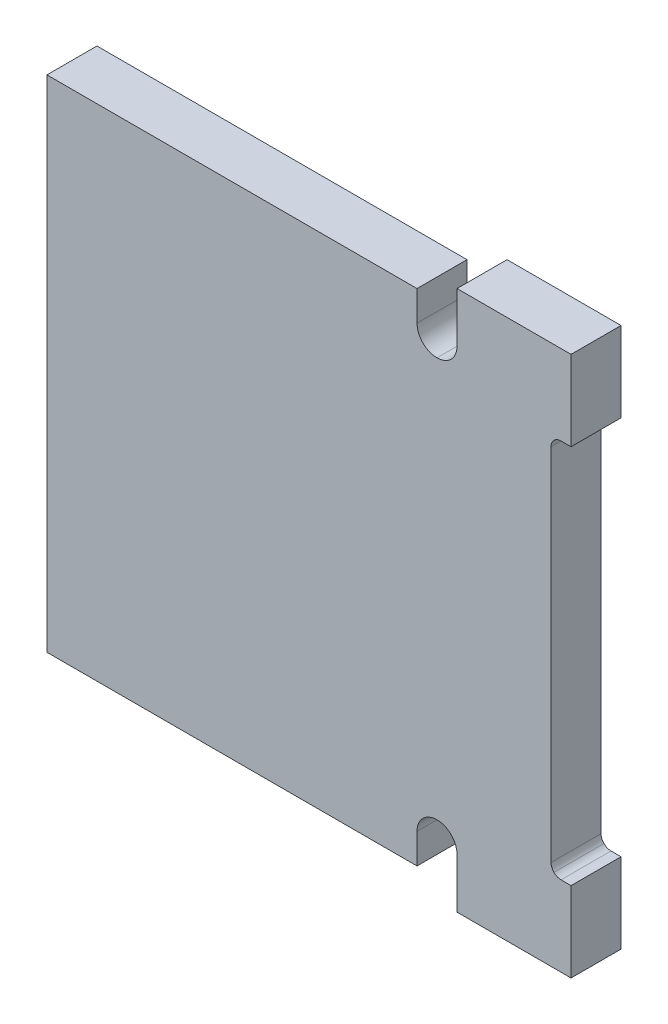
ISO-10303-21;
HEADER;
FILE_DESCRIPTION(('STEP AP214'),'2;1');
FILE_NAME('part.step','',(''),(''),'','','');
FILE_SCHEMA(('AUTOMOTIVE_DESIGN { 1 0 10303 214 1 1 1 1 }'));
ENDSEC;
DATA;
#1=APPLICATION_CONTEXT('core data for automotive mechanical design processes');
#2=APPLICATION_PROTOCOL_DEFINITION('international standard','automotive_design',2000,#1);
#3=PRODUCT_CONTEXT('',#1,'mechanical');
#4=PRODUCT('Part','Part','',(#3));
#5=PRODUCT_RELATED_PRODUCT_CATEGORY('part','',(#4));
#6=PRODUCT_DEFINITION_FORMATION('','',#4);
#7=PRODUCT_DEFINITION_CONTEXT('part definition',#1,'design');
#8=PRODUCT_DEFINITION('design','',#6,#7);
#9=PRODUCT_DEFINITION_SHAPE('','',#8);
#10=(LENGTH_UNIT() NAMED_UNIT(*) SI_UNIT(.MILLI.,.METRE.));
#11=(NAMED_UNIT(*) PLANE_ANGLE_UNIT() SI_UNIT($,.RADIAN.));
#12=(NAMED_UNIT(*) SI_UNIT($,.STERADIAN.) SOLID_ANGLE_UNIT());
#13=UNCERTAINTY_MEASURE_WITH_UNIT(LENGTH_MEASURE(1.E-05),#10,'distance_accuracy_value','');
#14=(GEOMETRIC_REPRESENTATION_CONTEXT(3) GLOBAL_UNCERTAINTY_ASSIGNED_CONTEXT((#13)) GLOBAL_UNIT_ASSIGNED_CONTEXT((#10,
#11,#12)) REPRESENTATION_CONTEXT('',''));
#15=CARTESIAN_POINT('',(0.,0.,0.));
#16=DIRECTION('',(0.,0.,1.));
#17=DIRECTION('',(1.,0.,0.));
#18=AXIS2_PLACEMENT_3D('',#15,#16,#17);
#19=CARTESIAN_POINT('',(2.5335472746525,0.,0.5));
#20=DIRECTION('',(0.,0.,1.));
#21=DIRECTION('',(1.,0.,0.));
#22=AXIS2_PLACEMENT_3D('',#19,#20,#21);
#23=PLANE('',#22);
#24=DIRECTION('',(0.,1.,0.));
#25=VECTOR('',#24,1.);
#26=CARTESIAN_POINT('',(-0.249999999999971,2.5,0.5));
#27=LINE('',#26,#25);
#28=CARTESIAN_POINT('',(-0.249999999999972,-2.50000000000011,0.5));
#29=VERTEX_POINT('',#28);
#30=CARTESIAN_POINT('',(-0.249999999999971,2.5,0.5));
#31=VERTEX_POINT('',#30);
#32=EDGE_CURVE('E299',#29,#31,#27,.T.);
#33=ORIENTED_EDGE('',*,*,#32,.F.);
#34=DIRECTION('',(-1.,0.,0.));
#35=VECTOR('',#34,1.);
#36=CARTESIAN_POINT('',(-0.249999999999972,-2.50000000000011,0.5));
#37=LINE('',#36,#35);
#38=CARTESIAN_POINT('',(3.45,-2.50000000000011,0.5));
#39=VERTEX_POINT('',#38);
#40=EDGE_CURVE('E11',#39,#29,#37,.T.);
#41=ORIENTED_EDGE('',*,*,#40,.F.);
#42=DIRECTION('',(0.,-1.,0.));
#43=VECTOR('',#42,1.);
#44=CARTESIAN_POINT('',(3.45000000000005,2.49999999999994,0.5));
#45=LINE('',#44,#43);
#46=CARTESIAN_POINT('',(3.45,-2.20000000000005,0.5));
#47=VERTEX_POINT('',#46);
#48=EDGE_CURVE('E183',#47,#39,#45,.T.);
#49=ORIENTED_EDGE('',*,*,#48,.F.);
#50=CARTESIAN_POINT('',(3.65,-2.20000000000005,0.5));
#51=DIRECTION('',(0.,0.,1.));
#52=DIRECTION('',(0.,1.,0.));
#53=AXIS2_PLACEMENT_3D('',#50,#51,#52);
#54=CIRCLE('',#53,0.199999999999989);
#55=CARTESIAN_POINT('',(3.65,-2.00000000000006,0.5));
#56=VERTEX_POINT('',#55);
#57=EDGE_CURVE('E552',#56,#47,#54,.T.);
#58=ORIENTED_EDGE('',*,*,#57,.F.);
#59=CARTESIAN_POINT('',(3.65,-2.20000000000005,0.5));
#60=DIRECTION('',(0.,0.,1.));
#61=DIRECTION('',(0.,1.,0.));
#62=AXIS2_PLACEMENT_3D('',#59,#60,#61);
#63=CIRCLE('',#62,0.199999999999989);
#64=CARTESIAN_POINT('',(3.85,-2.20000000000004,0.5));
#65=VERTEX_POINT('',#64);
#66=EDGE_CURVE('E180',#65,#56,#63,.T.);
#67=ORIENTED_EDGE('',*,*,#66,.F.);
#68=DIRECTION('',(0.,1.,0.));
#69=VECTOR('',#68,1.);
#70=CARTESIAN_POINT('',(3.85,0.999999999999772,0.5));
#71=LINE('',#70,#69);
#72=CARTESIAN_POINT('',(3.85,-2.7,0.5));
#73=VERTEX_POINT('',#72);
#74=EDGE_CURVE('E171',#73,#65,#71,.T.);
#75=ORIENTED_EDGE('',*,*,#74,.F.);
#76=DIRECTION('',(-1.,0.,0.));
#77=VECTOR('',#76,1.);
#78=CARTESIAN_POINT('',(3.85,-2.7,0.5));
#79=LINE('',#78,#77);
#80=CARTESIAN_POINT('',(4.99,-2.69999999999993,0.5));
#81=VERTEX_POINT('',#80);
#82=EDGE_CURVE('E133',#81,#73,#79,.T.);
#83=ORIENTED_EDGE('',*,*,#82,.F.);
#84=DIRECTION('',(0.,-1.,0.));
#85=VECTOR('',#84,1.);
#86=CARTESIAN_POINT('',(4.99,2.70000000000004,0.5));
#87=LINE('',#86,#85);
#88=CARTESIAN_POINT('',(4.99,-1.90000000000004,0.5));
#89=VERTEX_POINT('',#88);
#90=EDGE_CURVE('E124',#89,#81,#87,.T.);
#91=ORIENTED_EDGE('',*,*,#90,.F.);
#92=DIRECTION('',(1.,-2.84400785257291E-13,0.));
#93=VECTOR('',#92,1.);
#94=CARTESIAN_POINT('',(4.99,-1.90000000000004,0.5));
#95=LINE('',#94,#93);
#96=CARTESIAN_POINT('',(4.89,-1.9,0.5));
#97=VERTEX_POINT('',#96);
#98=EDGE_CURVE('E129',#97,#89,#95,.T.);
#99=ORIENTED_EDGE('',*,*,#98,.F.);
#100=CARTESIAN_POINT('',(4.89,-1.8,0.5));
#101=DIRECTION('',(0.,0.,1.));
#102=DIRECTION('',(-0.707106781186449,-0.707106781186646,0.));
#103=AXIS2_PLACEMENT_3D('',#100,#101,#102);
#104=CIRCLE('',#103,0.100000000000009);
#105=CARTESIAN_POINT('',(4.81928932188135,-1.87071067811867,0.5));
#106=VERTEX_POINT('',#105);
#107=EDGE_CURVE('E424',#106,#97,#104,.T.);
#108=ORIENTED_EDGE('',*,*,#107,.F.);
#109=CARTESIAN_POINT('',(4.89,-1.8,0.5));
#110=DIRECTION('',(0.,0.,1.));
#111=DIRECTION('',(-0.707106781186449,-0.707106781186646,0.));
#112=AXIS2_PLACEMENT_3D('',#109,#110,#111);
#113=CIRCLE('',#112,0.100000000000009);
#114=CARTESIAN_POINT('',(4.79,-1.8,0.5));
#115=VERTEX_POINT('',#114);
#116=EDGE_CURVE('E157',#115,#106,#113,.T.);
#117=ORIENTED_EDGE('',*,*,#116,.F.);
#118=DIRECTION('',(0.,-1.,0.));
#119=VECTOR('',#118,1.);
#120=CARTESIAN_POINT('',(4.79,-1.8,0.5));
#121=LINE('',#120,#119);
#122=CARTESIAN_POINT('',(4.79,1.79999999999995,0.5));
#123=VERTEX_POINT('',#122);
#124=EDGE_CURVE('E343',#123,#115,#121,.T.);
#125=ORIENTED_EDGE('',*,*,#124,.F.);
#126=CARTESIAN_POINT('',(4.89,1.79999999999995,0.5));
#127=DIRECTION('',(0.,0.,1.));
#128=DIRECTION('',(-0.707106781186547,0.707106781186549,0.));
#129=AXIS2_PLACEMENT_3D('',#126,#127,#128);
#130=CIRCLE('',#129,0.0999999999999942);
#131=CARTESIAN_POINT('',(4.81928932188135,1.8707106781186,0.5));
#132=VERTEX_POINT('',#131);
#133=EDGE_CURVE('E410',#132,#123,#130,.T.);
#134=ORIENTED_EDGE('',*,*,#133,.F.);
#135=CARTESIAN_POINT('',(4.89,1.79999999999995,0.5));
#136=DIRECTION('',(0.,0.,1.));
#137=DIRECTION('',(-0.707106781186547,0.707106781186549,0.));
#138=AXIS2_PLACEMENT_3D('',#135,#136,#137);
#139=CIRCLE('',#138,0.0999999999999942);
#140=CARTESIAN_POINT('',(4.89,1.89999999999995,0.5));
#141=VERTEX_POINT('',#140);
#142=EDGE_CURVE('E342',#141,#132,#139,.T.);
#143=ORIENTED_EDGE('',*,*,#142,.F.);
#144=DIRECTION('',(-1.,-2.84033403351144E-13,0.));
#145=VECTOR('',#144,1.);
#146=CARTESIAN_POINT('',(4.89,1.89999999999995,0.5));
#147=LINE('',#146,#145);
#148=CARTESIAN_POINT('',(4.99,1.9,0.5));
#149=VERTEX_POINT('',#148);
#150=EDGE_CURVE('E318',#149,#141,#147,.T.);
#151=ORIENTED_EDGE('',*,*,#150,.F.);
#152=DIRECTION('',(0.,-1.,0.));
#153=VECTOR('',#152,1.);
#154=CARTESIAN_POINT('',(4.99,1.9,0.5));
#155=LINE('',#154,#153);
#156=CARTESIAN_POINT('',(4.99,2.70000000000004,0.5));
#157=VERTEX_POINT('',#156);
#158=EDGE_CURVE('E319',#157,#149,#155,.T.);
#159=ORIENTED_EDGE('',*,*,#158,.F.);
#160=DIRECTION('',(1.,0.,0.));
#161=VECTOR('',#160,1.);
#162=CARTESIAN_POINT('',(4.99,2.70000000000004,0.5));
#163=LINE('',#162,#161);
#164=CARTESIAN_POINT('',(3.85000000000005,2.70000000000004,0.5));
#165=VERTEX_POINT('',#164);
#166=EDGE_CURVE('E254',#165,#157,#163,.T.);
#167=ORIENTED_EDGE('',*,*,#166,.F.);
#168=DIRECTION('',(0.,1.,0.));
#169=VECTOR('',#168,1.);
#170=CARTESIAN_POINT('',(3.85,0.999999999999772,0.5));
#171=LINE('',#170,#169);
#172=CARTESIAN_POINT('',(3.85,2.19999999999986,0.5));
#173=VERTEX_POINT('',#172);
#174=EDGE_CURVE('E255',#173,#165,#171,.T.);
#175=ORIENTED_EDGE('',*,*,#174,.F.);
#176=CARTESIAN_POINT('',(3.65,2.19999999999987,0.5));
#177=DIRECTION('',(0.,0.,1.));
#178=DIRECTION('',(0.,-1.,0.));
#179=AXIS2_PLACEMENT_3D('',#176,#177,#178);
#180=CIRCLE('',#179,0.200000000000003);
#181=CARTESIAN_POINT('',(3.65,1.99999999999987,0.5));
#182=VERTEX_POINT('',#181);
#183=EDGE_CURVE('E448',#182,#173,#180,.T.);
#184=ORIENTED_EDGE('',*,*,#183,.F.);
#185=CARTESIAN_POINT('',(3.65,2.19999999999987,0.5));
#186=DIRECTION('',(0.,0.,1.));
#187=DIRECTION('',(0.,-1.,0.));
#188=AXIS2_PLACEMENT_3D('',#185,#186,#187);
#189=CIRCLE('',#188,0.200000000000003);
#190=CARTESIAN_POINT('',(3.45,2.19999999999987,0.5));
#191=VERTEX_POINT('',#190);
#192=EDGE_CURVE('E325',#191,#182,#189,.T.);
#193=ORIENTED_EDGE('',*,*,#192,.F.);
#194=DIRECTION('',(0.,-1.,0.));
#195=VECTOR('',#194,1.);
#196=CARTESIAN_POINT('',(3.45,2.19999999999987,0.5));
#197=LINE('',#196,#195);
#198=CARTESIAN_POINT('',(3.45000000000005,2.49999999999994,0.5));
#199=VERTEX_POINT('',#198);
#200=EDGE_CURVE('E320',#199,#191,#197,.T.);
#201=ORIENTED_EDGE('',*,*,#200,.F.);
#202=DIRECTION('',(1.,0.,0.));
#203=VECTOR('',#202,1.);
#204=CARTESIAN_POINT('',(3.45000000000005,2.49999999999994,0.5));
#205=LINE('',#204,#203);
#206=EDGE_CURVE('E309',#31,#199,#205,.T.);
#207=ORIENTED_EDGE('',*,*,#206,.F.);
#208=EDGE_LOOP('',(#33,#41,#49,#58,#67,#75,#83,#91,#99,#108,#117,#125,#134,#143,#151,#159,#167,
#175,#184,#193,#201,#207));
#209=FACE_BOUND('',#208,.T.);
#210=ADVANCED_FACE('F17',(#209),#23,.T.);
#211=CARTESIAN_POINT('',(3.45,-2.50000000000011,0.));
#212=DIRECTION('',(0.,-1.,0.));
#213=DIRECTION('',(-1.,0.,0.));
#214=AXIS2_PLACEMENT_3D('',#211,#212,#213);
#215=PLANE('',#214);
#216=ORIENTED_EDGE('',*,*,#40,.T.);
#217=DIRECTION('',(0.,0.,1.));
#218=VECTOR('',#217,1.);
#219=CARTESIAN_POINT('',(-0.249999999999972,-2.50000000000011,0.));
#220=LINE('',#219,#218);
#221=CARTESIAN_POINT('',(-0.249999999999972,-2.50000000000011,0.));
#222=VERTEX_POINT('',#221);
#223=EDGE_CURVE('E295',#222,#29,#220,.T.);
#224=ORIENTED_EDGE('',*,*,#223,.F.);
#225=DIRECTION('',(1.,0.,0.));
#226=VECTOR('',#225,1.);
#227=CARTESIAN_POINT('',(-0.249999999999972,-2.50000000000011,0.));
#228=LINE('',#227,#226);
#229=CARTESIAN_POINT('',(3.45,-2.50000000000011,0.));
#230=VERTEX_POINT('',#229);
#231=EDGE_CURVE('E198',#222,#230,#228,.T.);
#232=ORIENTED_EDGE('',*,*,#231,.T.);
#233=DIRECTION('',(0.,0.,1.));
#234=VECTOR('',#233,1.);
#235=CARTESIAN_POINT('',(3.44999999999958,-2.50000000000011,0.));
#236=LINE('',#235,#234);
#237=EDGE_CURVE('E20',#230,#39,#236,.T.);
#238=ORIENTED_EDGE('',*,*,#237,.T.);
#239=EDGE_LOOP('',(#216,#224,#232,#238));
#240=FACE_BOUND('',#239,.T.);
#241=ADVANCED_FACE('F196',(#240),#215,.T.);
#242=CARTESIAN_POINT('',(3.45000000000005,2.49999999999994,0.));
#243=DIRECTION('',(1.,0.,0.));
#244=DIRECTION('',(0.,-1.,0.));
#245=AXIS2_PLACEMENT_3D('',#242,#243,#244);
#246=PLANE('',#245);
#247=ORIENTED_EDGE('',*,*,#48,.T.);
#248=ORIENTED_EDGE('',*,*,#237,.F.);
#249=DIRECTION('',(0.,1.,0.));
#250=VECTOR('',#249,1.);
#251=CARTESIAN_POINT('',(3.45000000000005,2.49999999999994,0.));
#252=LINE('',#251,#250);
#253=CARTESIAN_POINT('',(3.45,-2.20000000000005,0.));
#254=VERTEX_POINT('',#253);
#255=EDGE_CURVE('E203',#230,#254,#252,.T.);
#256=ORIENTED_EDGE('',*,*,#255,.T.);
#257=DIRECTION('',(0.,0.,1.));
#258=VECTOR('',#257,1.);
#259=CARTESIAN_POINT('',(3.44999999999981,-2.20000000000003,0.));
#260=LINE('',#259,#258);
#261=EDGE_CURVE('E549',#254,#47,#260,.T.);
#262=ORIENTED_EDGE('',*,*,#261,.T.);
#263=EDGE_LOOP('',(#247,#248,#256,#262));
#264=FACE_BOUND('',#263,.T.);
#265=ADVANCED_FACE('F201',(#264),#246,.T.);
#266=CARTESIAN_POINT('',(3.65,-2.20000000000005,0.));
#267=DIRECTION('',(0.,0.,1.));
#268=DIRECTION('',(0.,1.,0.));
#269=AXIS2_PLACEMENT_3D('',#266,#267,#268);
#270=CYLINDRICAL_SURFACE('',#269,0.199999999999989);
#271=DIRECTION('',(0.,0.,1.));
#272=VECTOR('',#271,1.);
#273=CARTESIAN_POINT('',(3.65,-2.00000000000006,0.));
#274=LINE('',#273,#272);
#275=CARTESIAN_POINT('',(3.65,-2.00000000000006,0.));
#276=VERTEX_POINT('',#275);
#277=EDGE_CURVE('E556',#276,#56,#274,.T.);
#278=ORIENTED_EDGE('',*,*,#277,.F.);
#279=CARTESIAN_POINT('',(3.65,-2.20000000000005,0.));
#280=DIRECTION('',(0.,0.,-1.));
#281=DIRECTION('',(0.,1.,0.));
#282=AXIS2_PLACEMENT_3D('',#279,#280,#281);
#283=CIRCLE('',#282,0.199999999999989);
#284=CARTESIAN_POINT('',(3.85,-2.20000000000004,0.));
#285=VERTEX_POINT('',#284);
#286=EDGE_CURVE('E257',#276,#285,#283,.T.);
#287=ORIENTED_EDGE('',*,*,#286,.T.);
#288=DIRECTION('',(0.,0.,1.));
#289=VECTOR('',#288,1.);
#290=CARTESIAN_POINT('',(3.85,-2.20000000000005,0.));
#291=LINE('',#290,#289);
#292=EDGE_CURVE('E175',#285,#65,#291,.T.);
#293=ORIENTED_EDGE('',*,*,#292,.T.);
#294=ORIENTED_EDGE('',*,*,#66,.T.);
#295=EDGE_LOOP('',(#278,#287,#293,#294));
#296=FACE_BOUND('',#295,.T.);
#297=ADVANCED_FACE('F1202',(#296),#270,.F.);
#298=CARTESIAN_POINT('',(3.85,0.999999999999772,0.));
#299=DIRECTION('',(1.,0.,0.));
#300=DIRECTION('',(0.,-1.,0.));
#301=AXIS2_PLACEMENT_3D('',#298,#299,#300);
#302=PLANE('',#301);
#303=ORIENTED_EDGE('',*,*,#74,.T.);
#304=ORIENTED_EDGE('',*,*,#292,.F.);
#305=DIRECTION('',(0.,-1.,0.));
#306=VECTOR('',#305,1.);
#307=CARTESIAN_POINT('',(3.85,0.999999999999772,0.));
#308=LINE('',#307,#306);
#309=CARTESIAN_POINT('',(3.85,-2.7,0.));
#310=VERTEX_POINT('',#309);
#311=EDGE_CURVE('E236',#285,#310,#308,.T.);
#312=ORIENTED_EDGE('',*,*,#311,.T.);
#313=DIRECTION('',(0.,0.,1.));
#314=VECTOR('',#313,1.);
#315=CARTESIAN_POINT('',(3.85,-2.7,0.));
#316=LINE('',#315,#314);
#317=EDGE_CURVE('E176',#310,#73,#316,.T.);
#318=ORIENTED_EDGE('',*,*,#317,.T.);
#319=EDGE_LOOP('',(#303,#304,#312,#318));
#320=FACE_BOUND('',#319,.T.);
#321=ADVANCED_FACE('F766',(#320),#302,.F.);
#322=CARTESIAN_POINT('',(4.99,-2.69999999999993,0.));
#323=DIRECTION('',(0.,-1.,0.));
#324=DIRECTION('',(0.,0.,-1.));
#325=AXIS2_PLACEMENT_3D('',#322,#323,#324);
#326=PLANE('',#325);
#327=ORIENTED_EDGE('',*,*,#82,.T.);
#328=ORIENTED_EDGE('',*,*,#317,.F.);
#329=DIRECTION('',(1.,0.,0.));
#330=VECTOR('',#329,1.);
#331=CARTESIAN_POINT('',(3.85,-2.7,0.));
#332=LINE('',#331,#330);
#333=CARTESIAN_POINT('',(4.99,-2.69999999999993,0.));
#334=VERTEX_POINT('',#333);
#335=EDGE_CURVE('E229',#310,#334,#332,.T.);
#336=ORIENTED_EDGE('',*,*,#335,.T.);
#337=DIRECTION('',(0.,0.,1.));
#338=VECTOR('',#337,1.);
#339=CARTESIAN_POINT('',(4.99,-2.69999999999993,0.));
#340=LINE('',#339,#338);
#341=EDGE_CURVE('E138',#334,#81,#340,.T.);
#342=ORIENTED_EDGE('',*,*,#341,.T.);
#343=EDGE_LOOP('',(#327,#328,#336,#342));
#344=FACE_BOUND('',#343,.T.);
#345=ADVANCED_FACE('F230',(#344),#326,.T.);
#346=CARTESIAN_POINT('',(4.99,2.70000000000004,0.));
#347=DIRECTION('',(1.,0.,0.));
#348=DIRECTION('',(0.,-1.,0.));
#349=AXIS2_PLACEMENT_3D('',#346,#347,#348);
#350=PLANE('',#349);
#351=ORIENTED_EDGE('',*,*,#90,.T.);
#352=ORIENTED_EDGE('',*,*,#341,.F.);
#353=DIRECTION('',(0.,1.,0.));
#354=VECTOR('',#353,1.);
#355=CARTESIAN_POINT('',(4.99,2.70000000000004,0.));
#356=LINE('',#355,#354);
#357=CARTESIAN_POINT('',(4.99,-1.90000000000004,0.));
#358=VERTEX_POINT('',#357);
#359=EDGE_CURVE('E146',#334,#358,#356,.T.);
#360=ORIENTED_EDGE('',*,*,#359,.T.);
#361=DIRECTION('',(0.,0.,1.));
#362=VECTOR('',#361,1.);
#363=CARTESIAN_POINT('',(4.99,-1.90000000000004,0.));
#364=LINE('',#363,#362);
#365=EDGE_CURVE('E139',#358,#89,#364,.T.);
#366=ORIENTED_EDGE('',*,*,#365,.T.);
#367=EDGE_LOOP('',(#351,#352,#360,#366));
#368=FACE_BOUND('',#367,.T.);
#369=ADVANCED_FACE('F143',(#368),#350,.T.);
#370=CARTESIAN_POINT('',(4.89,-1.9,0.));
#371=DIRECTION('',(2.84400785257291E-13,1.,0.));
#372=DIRECTION('',(1.,-2.84400785257291E-13,0.));
#373=AXIS2_PLACEMENT_3D('',#370,#371,#372);
#374=PLANE('',#373);
#375=ORIENTED_EDGE('',*,*,#98,.T.);
#376=ORIENTED_EDGE('',*,*,#365,.F.);
#377=DIRECTION('',(-1.,2.84400785257291E-13,0.));
#378=VECTOR('',#377,1.);
#379=CARTESIAN_POINT('',(4.99,-1.90000000000004,0.));
#380=LINE('',#379,#378);
#381=CARTESIAN_POINT('',(4.89,-1.9,0.));
#382=VERTEX_POINT('',#381);
#383=EDGE_CURVE('E241',#358,#382,#380,.T.);
#384=ORIENTED_EDGE('',*,*,#383,.T.);
#385=DIRECTION('',(0.,0.,1.));
#386=VECTOR('',#385,1.);
#387=CARTESIAN_POINT('',(4.89,-1.9,0.));
#388=LINE('',#387,#386);
#389=EDGE_CURVE('E154',#382,#97,#388,.T.);
#390=ORIENTED_EDGE('',*,*,#389,.T.);
#391=EDGE_LOOP('',(#375,#376,#384,#390));
#392=FACE_BOUND('',#391,.T.);
#393=ADVANCED_FACE('F152',(#392),#374,.T.);
#394=CARTESIAN_POINT('',(4.89,-1.8,0.));
#395=DIRECTION('',(0.,0.,1.));
#396=DIRECTION('',(-0.707106781186449,-0.707106781186646,0.));
#397=AXIS2_PLACEMENT_3D('',#394,#395,#396);
#398=CYLINDRICAL_SURFACE('',#397,0.100000000000009);
#399=DIRECTION('',(0.,0.,1.));
#400=VECTOR('',#399,1.);
#401=CARTESIAN_POINT('',(4.81928932188135,-1.87071067811867,0.));
#402=LINE('',#401,#400);
#403=CARTESIAN_POINT('',(4.81928932188135,-1.87071067811867,0.));
#404=VERTEX_POINT('',#403);
#405=EDGE_CURVE('E427',#404,#106,#402,.T.);
#406=ORIENTED_EDGE('',*,*,#405,.F.);
#407=CARTESIAN_POINT('',(4.89,-1.8,0.));
#408=DIRECTION('',(0.,0.,-1.));
#409=DIRECTION('',(-0.707106781186449,-0.707106781186646,0.));
#410=AXIS2_PLACEMENT_3D('',#407,#408,#409);
#411=CIRCLE('',#410,0.100000000000009);
#412=CARTESIAN_POINT('',(4.79,-1.8,0.));
#413=VERTEX_POINT('',#412);
#414=EDGE_CURVE('E247',#404,#413,#411,.T.);
#415=ORIENTED_EDGE('',*,*,#414,.T.);
#416=DIRECTION('',(0.,0.,1.));
#417=VECTOR('',#416,1.);
#418=CARTESIAN_POINT('',(4.79,-1.8,0.));
#419=LINE('',#418,#417);
#420=EDGE_CURVE('E164',#413,#115,#419,.T.);
#421=ORIENTED_EDGE('',*,*,#420,.T.);
#422=ORIENTED_EDGE('',*,*,#116,.T.);
#423=EDGE_LOOP('',(#406,#415,#421,#422));
#424=FACE_BOUND('',#423,.T.);
#425=ADVANCED_FACE('F806',(#424),#398,.F.);
#426=CARTESIAN_POINT('',(4.79,1.79999999999995,0.));
#427=DIRECTION('',(1.,0.,0.));
#428=DIRECTION('',(0.,-1.,0.));
#429=AXIS2_PLACEMENT_3D('',#426,#427,#428);
#430=PLANE('',#429);
#431=ORIENTED_EDGE('',*,*,#124,.T.);
#432=ORIENTED_EDGE('',*,*,#420,.F.);
#433=DIRECTION('',(0.,1.,0.));
#434=VECTOR('',#433,1.);
#435=CARTESIAN_POINT('',(4.79,-1.8,0.));
#436=LINE('',#435,#434);
#437=CARTESIAN_POINT('',(4.79,1.79999999999995,0.));
#438=VERTEX_POINT('',#437);
#439=EDGE_CURVE('E386',#413,#438,#436,.T.);
#440=ORIENTED_EDGE('',*,*,#439,.T.);
#441=DIRECTION('',(0.,0.,1.));
#442=VECTOR('',#441,1.);
#443=CARTESIAN_POINT('',(4.79,1.79999999999995,0.));
#444=LINE('',#443,#442);
#445=EDGE_CURVE('E398',#438,#123,#444,.T.);
#446=ORIENTED_EDGE('',*,*,#445,.T.);
#447=EDGE_LOOP('',(#431,#432,#440,#446));
#448=FACE_BOUND('',#447,.T.);
#449=ADVANCED_FACE('F396',(#448),#430,.T.);
#450=CARTESIAN_POINT('',(4.89,1.79999999999995,0.));
#451=DIRECTION('',(0.,0.,1.));
#452=DIRECTION('',(-0.707106781186547,0.707106781186549,0.));
#453=AXIS2_PLACEMENT_3D('',#450,#451,#452);
#454=CYLINDRICAL_SURFACE('',#453,0.0999999999999942);
#455=DIRECTION('',(0.,0.,1.));
#456=VECTOR('',#455,1.);
#457=CARTESIAN_POINT('',(4.81928932188135,1.8707106781186,0.));
#458=LINE('',#457,#456);
#459=CARTESIAN_POINT('',(4.81928932188135,1.8707106781186,0.));
#460=VERTEX_POINT('',#459);
#461=EDGE_CURVE('E417',#460,#132,#458,.T.);
#462=ORIENTED_EDGE('',*,*,#461,.F.);
#463=CARTESIAN_POINT('',(4.89,1.79999999999995,0.));
#464=DIRECTION('',(0.,0.,-1.));
#465=DIRECTION('',(-0.707106781186547,0.707106781186549,0.));
#466=AXIS2_PLACEMENT_3D('',#463,#464,#465);
#467=CIRCLE('',#466,0.0999999999999942);
#468=CARTESIAN_POINT('',(4.89,1.89999999999995,0.));
#469=VERTEX_POINT('',#468);
#470=EDGE_CURVE('E382',#460,#469,#467,.T.);
#471=ORIENTED_EDGE('',*,*,#470,.T.);
#472=DIRECTION('',(0.,0.,1.));
#473=VECTOR('',#472,1.);
#474=CARTESIAN_POINT('',(4.89,1.89999999999995,0.));
#475=LINE('',#474,#473);
#476=EDGE_CURVE('E338',#469,#141,#475,.T.);
#477=ORIENTED_EDGE('',*,*,#476,.T.);
#478=ORIENTED_EDGE('',*,*,#142,.T.);
#479=EDGE_LOOP('',(#462,#471,#477,#478));
#480=FACE_BOUND('',#479,.T.);
#481=ADVANCED_FACE('F1138',(#480),#454,.F.);
#482=CARTESIAN_POINT('',(4.99,1.9,0.));
#483=DIRECTION('',(2.84033403351144E-13,-1.,0.));
#484=DIRECTION('',(0.,0.,-1.));
#485=AXIS2_PLACEMENT_3D('',#482,#483,#484);
#486=PLANE('',#485);
#487=ORIENTED_EDGE('',*,*,#150,.T.);
#488=ORIENTED_EDGE('',*,*,#476,.F.);
#489=DIRECTION('',(1.,2.84033403351144E-13,0.));
#490=VECTOR('',#489,1.);
#491=CARTESIAN_POINT('',(4.89,1.89999999999995,0.));
#492=LINE('',#491,#490);
#493=CARTESIAN_POINT('',(4.99,1.9,0.));
#494=VERTEX_POINT('',#493);
#495=EDGE_CURVE('E375',#469,#494,#492,.T.);
#496=ORIENTED_EDGE('',*,*,#495,.T.);
#497=DIRECTION('',(0.,0.,1.));
#498=VECTOR('',#497,1.);
#499=CARTESIAN_POINT('',(4.99,1.9,0.));
#500=LINE('',#499,#498);
#501=EDGE_CURVE('E314',#494,#149,#500,.T.);
#502=ORIENTED_EDGE('',*,*,#501,.T.);
#503=EDGE_LOOP('',(#487,#488,#496,#502));
#504=FACE_BOUND('',#503,.T.);
#505=ADVANCED_FACE('F525',(#504),#486,.T.);
#506=CARTESIAN_POINT('',(4.99,2.70000000000004,0.));
#507=DIRECTION('',(1.,0.,0.));
#508=DIRECTION('',(0.,-1.,0.));
#509=AXIS2_PLACEMENT_3D('',#506,#507,#508);
#510=PLANE('',#509);
#511=ORIENTED_EDGE('',*,*,#158,.T.);
#512=ORIENTED_EDGE('',*,*,#501,.F.);
#513=DIRECTION('',(0.,1.,0.));
#514=VECTOR('',#513,1.);
#515=CARTESIAN_POINT('',(4.99,1.9,0.));
#516=LINE('',#515,#514);
#517=CARTESIAN_POINT('',(4.99,2.70000000000004,0.));
#518=VERTEX_POINT('',#517);
#519=EDGE_CURVE('E370',#494,#518,#516,.T.);
#520=ORIENTED_EDGE('',*,*,#519,.T.);
#521=DIRECTION('',(0.,0.,1.));
#522=VECTOR('',#521,1.);
#523=CARTESIAN_POINT('',(4.99,2.70000000000004,0.));
#524=LINE('',#523,#522);
#525=EDGE_CURVE('E332',#518,#157,#524,.T.);
#526=ORIENTED_EDGE('',*,*,#525,.T.);
#527=EDGE_LOOP('',(#511,#512,#520,#526));
#528=FACE_BOUND('',#527,.T.);
#529=ADVANCED_FACE('F521',(#528),#510,.T.);
#530=CARTESIAN_POINT('',(3.85000000000005,2.70000000000004,0.));
#531=DIRECTION('',(0.,1.,0.));
#532=DIRECTION('',(1.,0.,0.));
#533=AXIS2_PLACEMENT_3D('',#530,#531,#532);
#534=PLANE('',#533);
#535=ORIENTED_EDGE('',*,*,#166,.T.);
#536=ORIENTED_EDGE('',*,*,#525,.F.);
#537=DIRECTION('',(-1.,0.,0.));
#538=VECTOR('',#537,1.);
#539=CARTESIAN_POINT('',(4.99,2.70000000000004,0.));
#540=LINE('',#539,#538);
#541=CARTESIAN_POINT('',(3.85000000000005,2.70000000000004,0.));
#542=VERTEX_POINT('',#541);
#543=EDGE_CURVE('E366',#518,#542,#540,.T.);
#544=ORIENTED_EDGE('',*,*,#543,.T.);
#545=DIRECTION('',(0.,0.,1.));
#546=VECTOR('',#545,1.);
#547=CARTESIAN_POINT('',(3.85,2.70000000000004,0.));
#548=LINE('',#547,#546);
#549=EDGE_CURVE('E251',#542,#165,#548,.T.);
#550=ORIENTED_EDGE('',*,*,#549,.T.);
#551=EDGE_LOOP('',(#535,#536,#544,#550));
#552=FACE_BOUND('',#551,.T.);
#553=ADVANCED_FACE('F529',(#552),#534,.T.);
#554=CARTESIAN_POINT('',(3.85,0.999999999999772,0.));
#555=DIRECTION('',(1.,0.,0.));
#556=DIRECTION('',(0.,-1.,0.));
#557=AXIS2_PLACEMENT_3D('',#554,#555,#556);
#558=PLANE('',#557);
#559=ORIENTED_EDGE('',*,*,#174,.T.);
#560=ORIENTED_EDGE('',*,*,#549,.F.);
#561=DIRECTION('',(0.,-1.,0.));
#562=VECTOR('',#561,1.);
#563=CARTESIAN_POINT('',(3.85,0.999999999999772,0.));
#564=LINE('',#563,#562);
#565=CARTESIAN_POINT('',(3.85,2.19999999999986,0.));
#566=VERTEX_POINT('',#565);
#567=EDGE_CURVE('E371',#542,#566,#564,.T.);
#568=ORIENTED_EDGE('',*,*,#567,.T.);
#569=DIRECTION('',(0.,0.,1.));
#570=VECTOR('',#569,1.);
#571=CARTESIAN_POINT('',(3.85,2.19999999999987,0.));
#572=LINE('',#571,#570);
#573=EDGE_CURVE('E452',#566,#173,#572,.T.);
#574=ORIENTED_EDGE('',*,*,#573,.T.);
#575=EDGE_LOOP('',(#559,#560,#568,#574));
#576=FACE_BOUND('',#575,.T.);
#577=ADVANCED_FACE('F534',(#576),#558,.F.);
#578=CARTESIAN_POINT('',(3.65,2.19999999999987,0.));
#579=DIRECTION('',(0.,0.,1.));
#580=DIRECTION('',(0.,-1.,0.));
#581=AXIS2_PLACEMENT_3D('',#578,#579,#580);
#582=CYLINDRICAL_SURFACE('',#581,0.200000000000003);
#583=DIRECTION('',(0.,0.,1.));
#584=VECTOR('',#583,1.);
#585=CARTESIAN_POINT('',(3.65,1.99999999999987,0.));
#586=LINE('',#585,#584);
#587=CARTESIAN_POINT('',(3.65,1.99999999999987,0.));
#588=VERTEX_POINT('',#587);
#589=EDGE_CURVE('E447',#588,#182,#586,.T.);
#590=ORIENTED_EDGE('',*,*,#589,.F.);
#591=CARTESIAN_POINT('',(3.65,2.19999999999987,0.));
#592=DIRECTION('',(0.,0.,-1.));
#593=DIRECTION('',(0.,-1.,0.));
#594=AXIS2_PLACEMENT_3D('',#591,#592,#593);
#595=CIRCLE('',#594,0.200000000000003);
#596=CARTESIAN_POINT('',(3.45,2.19999999999987,0.));
#597=VERTEX_POINT('',#596);
#598=EDGE_CURVE('E364',#588,#597,#595,.T.);
#599=ORIENTED_EDGE('',*,*,#598,.T.);
#600=DIRECTION('',(0.,0.,1.));
#601=VECTOR('',#600,1.);
#602=CARTESIAN_POINT('',(3.45,2.19999999999987,0.));
#603=LINE('',#602,#601);
#604=EDGE_CURVE('E324',#597,#191,#603,.T.);
#605=ORIENTED_EDGE('',*,*,#604,.T.);
#606=ORIENTED_EDGE('',*,*,#192,.T.);
#607=EDGE_LOOP('',(#590,#599,#605,#606));
#608=FACE_BOUND('',#607,.T.);
#609=ADVANCED_FACE('F576',(#608),#582,.F.);
#610=CARTESIAN_POINT('',(3.45000000000005,2.49999999999994,0.));
#611=DIRECTION('',(1.,0.,0.));
#612=DIRECTION('',(0.,-1.,0.));
#613=AXIS2_PLACEMENT_3D('',#610,#611,#612);
#614=PLANE('',#613);
#615=ORIENTED_EDGE('',*,*,#200,.T.);
#616=ORIENTED_EDGE('',*,*,#604,.F.);
#617=DIRECTION('',(0.,1.,0.));
#618=VECTOR('',#617,1.);
#619=CARTESIAN_POINT('',(3.45,2.19999999999987,0.));
#620=LINE('',#619,#618);
#621=CARTESIAN_POINT('',(3.45000000000005,2.49999999999994,0.));
#622=VERTEX_POINT('',#621);
#623=EDGE_CURVE('E458',#597,#622,#620,.T.);
#624=ORIENTED_EDGE('',*,*,#623,.T.);
#625=DIRECTION('',(0.,0.,1.));
#626=VECTOR('',#625,1.);
#627=CARTESIAN_POINT('',(3.45000000000005,2.49999999999994,0.));
#628=LINE('',#627,#626);
#629=EDGE_CURVE('E313',#622,#199,#628,.T.);
#630=ORIENTED_EDGE('',*,*,#629,.T.);
#631=EDGE_LOOP('',(#615,#616,#624,#630));
#632=FACE_BOUND('',#631,.T.);
#633=ADVANCED_FACE('F582',(#632),#614,.T.);
#634=CARTESIAN_POINT('',(-0.249999999999971,2.5,0.));
#635=DIRECTION('',(0.,1.,0.));
#636=DIRECTION('',(1.,0.,0.));
#637=AXIS2_PLACEMENT_3D('',#634,#635,#636);
#638=PLANE('',#637);
#639=ORIENTED_EDGE('',*,*,#206,.T.);
#640=ORIENTED_EDGE('',*,*,#629,.F.);
#641=DIRECTION('',(-1.,0.,0.));
#642=VECTOR('',#641,1.);
#643=CARTESIAN_POINT('',(3.45000000000005,2.49999999999994,0.));
#644=LINE('',#643,#642);
#645=CARTESIAN_POINT('',(-0.249999999999971,2.5,0.));
#646=VERTEX_POINT('',#645);
#647=EDGE_CURVE('E433',#622,#646,#644,.T.);
#648=ORIENTED_EDGE('',*,*,#647,.T.);
#649=DIRECTION('',(0.,0.,1.));
#650=VECTOR('',#649,1.);
#651=CARTESIAN_POINT('',(-0.249999999999971,2.5,0.));
#652=LINE('',#651,#650);
#653=EDGE_CURVE('E305',#646,#31,#652,.T.);
#654=ORIENTED_EDGE('',*,*,#653,.T.);
#655=EDGE_LOOP('',(#639,#640,#648,#654));
#656=FACE_BOUND('',#655,.T.);
#657=ADVANCED_FACE('F1093',(#656),#638,.T.);
#658=CARTESIAN_POINT('',(-0.249999999999972,-2.50000000000011,0.));
#659=DIRECTION('',(-1.,0.,0.));
#660=DIRECTION('',(0.,0.,1.));
#661=AXIS2_PLACEMENT_3D('',#658,#659,#660);
#662=PLANE('',#661);
#663=DIRECTION('',(0.,0.,1.));
#664=VECTOR('',#663,1.);
#665=CARTESIAN_POINT('',(-0.249999999999972,0.499999999999943,0.));
#666=LINE('',#665,#664);
#667=CARTESIAN_POINT('',(-0.249999999999972,0.499999999999943,0.));
#668=VERTEX_POINT('',#667);
#669=CARTESIAN_POINT('',(-0.249999999999972,0.499999999999943,0.03));
#670=VERTEX_POINT('',#669);
#671=EDGE_CURVE('E265',#668,#670,#666,.T.);
#672=ORIENTED_EDGE('',*,*,#671,.T.);
#673=DIRECTION('',(0.,-1.,0.));
#674=VECTOR('',#673,1.);
#675=CARTESIAN_POINT('',(-0.249999999999972,-1.25000000000009,0.03));
#676=LINE('',#675,#674);
#677=CARTESIAN_POINT('',(-0.249999999999972,-0.500000000000057,0.03));
#678=VERTEX_POINT('',#677);
#679=EDGE_CURVE('E291',#670,#678,#676,.T.);
#680=ORIENTED_EDGE('',*,*,#679,.T.);
#681=DIRECTION('',(0.,0.,-1.));
#682=VECTOR('',#681,1.);
#683=CARTESIAN_POINT('',(-0.249999999999972,-0.500000000000057,0.));
#684=LINE('',#683,#682);
#685=CARTESIAN_POINT('',(-0.249999999999972,-0.500000000000057,0.));
#686=VERTEX_POINT('',#685);
#687=EDGE_CURVE('E266',#678,#686,#684,.T.);
#688=ORIENTED_EDGE('',*,*,#687,.T.);
#689=DIRECTION('',(0.,-1.,0.));
#690=VECTOR('',#689,1.);
#691=CARTESIAN_POINT('',(-0.249999999999971,2.5,0.));
#692=LINE('',#691,#690);
#693=EDGE_CURVE('E271',#686,#222,#692,.T.);
#694=ORIENTED_EDGE('',*,*,#693,.T.);
#695=ORIENTED_EDGE('',*,*,#223,.T.);
#696=ORIENTED_EDGE('',*,*,#32,.T.);
#697=ORIENTED_EDGE('',*,*,#653,.F.);
#698=DIRECTION('',(0.,-1.,0.));
#699=VECTOR('',#698,1.);
#700=CARTESIAN_POINT('',(-0.249999999999971,2.5,0.));
#701=LINE('',#700,#699);
#702=EDGE_CURVE('E430',#646,#668,#701,.T.);
#703=ORIENTED_EDGE('',*,*,#702,.T.);
#704=EDGE_LOOP('',(#672,#680,#688,#694,#695,#696,#697,#703));
#705=FACE_BOUND('',#704,.T.);
#706=ADVANCED_FACE('F1083',(#705),#662,.T.);
#707=CARTESIAN_POINT('',(-0.0999999999999091,0.,0.03));
#708=DIRECTION('',(0.,0.,1.));
#709=DIRECTION('',(1.,0.,0.));
#710=AXIS2_PLACEMENT_3D('',#707,#708,#709);
#711=PLANE('',#710);
#712=DIRECTION('',(-1.,0.,0.));
#713=VECTOR('',#712,1.);
#714=CARTESIAN_POINT('',(0.0500000000001534,-0.500000000000057,0.03));
#715=LINE('',#714,#713);
#716=CARTESIAN_POINT('',(0.0500000000001534,-0.500000000000057,0.03));
#717=VERTEX_POINT('',#716);
#718=EDGE_CURVE('E280',#717,#678,#715,.T.);
#719=ORIENTED_EDGE('',*,*,#718,.T.);
#720=ORIENTED_EDGE('',*,*,#679,.F.);
#721=DIRECTION('',(1.,0.,0.));
#722=VECTOR('',#721,1.);
#723=CARTESIAN_POINT('',(-0.249999999999972,0.499999999999943,0.03));
#724=LINE('',#723,#722);
#725=CARTESIAN_POINT('',(0.0500000000001536,0.499999999999943,0.03));
#726=VERTEX_POINT('',#725);
#727=EDGE_CURVE('E261',#670,#726,#724,.T.);
#728=ORIENTED_EDGE('',*,*,#727,.T.);
#729=DIRECTION('',(0.,-1.,0.));
#730=VECTOR('',#729,1.);
#731=CARTESIAN_POINT('',(0.0500000000001536,0.499999999999943,0.03));
#732=LINE('',#731,#730);
#733=EDGE_CURVE('E287',#726,#717,#732,.T.);
#734=ORIENTED_EDGE('',*,*,#733,.T.);
#735=EDGE_LOOP('',(#719,#720,#728,#734));
#736=FACE_BOUND('',#735,.T.);
#737=ADVANCED_FACE('F479',(#736),#711,.F.);
#738=CARTESIAN_POINT('',(0.0500000000001536,0.499999999999943,0.));
#739=DIRECTION('',(1.,0.,0.));
#740=DIRECTION('',(0.,-1.,0.));
#741=AXIS2_PLACEMENT_3D('',#738,#739,#740);
#742=PLANE('',#741);
#743=ORIENTED_EDGE('',*,*,#733,.F.);
#744=DIRECTION('',(0.,0.,1.));
#745=VECTOR('',#744,1.);
#746=CARTESIAN_POINT('',(0.0500000000001536,0.499999999999943,0.));
#747=LINE('',#746,#745);
#748=CARTESIAN_POINT('',(0.0500000000001536,0.499999999999943,0.));
#749=VERTEX_POINT('',#748);
#750=EDGE_CURVE('E292',#749,#726,#747,.T.);
#751=ORIENTED_EDGE('',*,*,#750,.F.);
#752=DIRECTION('',(0.,1.,0.));
#753=VECTOR('',#752,1.);
#754=CARTESIAN_POINT('',(0.0500000000001535,0.249999999999971,0.));
#755=LINE('',#754,#753);
#756=CARTESIAN_POINT('',(0.0500000000001534,-0.500000000000057,0.));
#757=VERTEX_POINT('',#756);
#758=EDGE_CURVE('E276',#757,#749,#755,.T.);
#759=ORIENTED_EDGE('',*,*,#758,.F.);
#760=DIRECTION('',(0.,0.,1.));
#761=VECTOR('',#760,1.);
#762=CARTESIAN_POINT('',(0.0500000000001534,-0.500000000000057,0.));
#763=LINE('',#762,#761);
#764=EDGE_CURVE('E284',#757,#717,#763,.T.);
#765=ORIENTED_EDGE('',*,*,#764,.T.);
#766=EDGE_LOOP('',(#743,#751,#759,#765));
#767=FACE_BOUND('',#766,.T.);
#768=ADVANCED_FACE('F468',(#767),#742,.F.);
#769=CARTESIAN_POINT('',(-0.249999999999972,0.499999999999943,0.));
#770=DIRECTION('',(0.,1.,0.));
#771=DIRECTION('',(1.,0.,0.));
#772=AXIS2_PLACEMENT_3D('',#769,#770,#771);
#773=PLANE('',#772);
#774=ORIENTED_EDGE('',*,*,#727,.F.);
#775=ORIENTED_EDGE('',*,*,#671,.F.);
#776=DIRECTION('',(-1.,0.,0.));
#777=VECTOR('',#776,1.);
#778=CARTESIAN_POINT('',(1.14177363732626,0.499999999999943,0.));
#779=LINE('',#778,#777);
#780=EDGE_CURVE('E434',#749,#668,#779,.T.);
#781=ORIENTED_EDGE('',*,*,#780,.F.);
#782=ORIENTED_EDGE('',*,*,#750,.T.);
#783=EDGE_LOOP('',(#774,#775,#781,#782));
#784=FACE_BOUND('',#783,.T.);
#785=ADVANCED_FACE('F484',(#784),#773,.F.);
#786=CARTESIAN_POINT('',(0.0500000000001534,-0.500000000000057,0.));
#787=DIRECTION('',(0.,-1.,0.));
#788=DIRECTION('',(-1.,0.,0.));
#789=AXIS2_PLACEMENT_3D('',#786,#787,#788);
#790=PLANE('',#789);
#791=ORIENTED_EDGE('',*,*,#718,.F.);
#792=ORIENTED_EDGE('',*,*,#764,.F.);
#793=DIRECTION('',(1.,0.,0.));
#794=VECTOR('',#793,1.);
#795=CARTESIAN_POINT('',(1.29177363732633,-0.500000000000057,0.));
#796=LINE('',#795,#794);
#797=EDGE_CURVE('E272',#686,#757,#796,.T.);
#798=ORIENTED_EDGE('',*,*,#797,.F.);
#799=ORIENTED_EDGE('',*,*,#687,.F.);
#800=EDGE_LOOP('',(#791,#792,#798,#799));
#801=FACE_BOUND('',#800,.T.);
#802=ADVANCED_FACE('F476',(#801),#790,.F.);
#803=CARTESIAN_POINT('',(3.55,-1.85369262646966E-13,0.));
#804=DIRECTION('',(0.,0.,1.));
#805=DIRECTION('',(1.,0.,0.));
#806=AXIS2_PLACEMENT_3D('',#803,#804,#805);
#807=PLANE('',#806);
#808=ORIENTED_EDGE('',*,*,#780,.T.);
#809=ORIENTED_EDGE('',*,*,#702,.F.);
#810=ORIENTED_EDGE('',*,*,#647,.F.);
#811=ORIENTED_EDGE('',*,*,#623,.F.);
#812=ORIENTED_EDGE('',*,*,#598,.F.);
#813=CARTESIAN_POINT('',(3.65,2.19999999999987,0.));
#814=DIRECTION('',(0.,0.,-1.));
#815=DIRECTION('',(0.,-1.,0.));
#816=AXIS2_PLACEMENT_3D('',#813,#814,#815);
#817=CIRCLE('',#816,0.200000000000003);
#818=EDGE_CURVE('E412',#566,#588,#817,.T.);
#819=ORIENTED_EDGE('',*,*,#818,.F.);
#820=ORIENTED_EDGE('',*,*,#567,.F.);
#821=ORIENTED_EDGE('',*,*,#543,.F.);
#822=ORIENTED_EDGE('',*,*,#519,.F.);
#823=ORIENTED_EDGE('',*,*,#495,.F.);
#824=ORIENTED_EDGE('',*,*,#470,.F.);
#825=CARTESIAN_POINT('',(4.89,1.79999999999995,0.));
#826=DIRECTION('',(0.,0.,-1.));
#827=DIRECTION('',(-0.707106781186547,0.707106781186549,0.));
#828=AXIS2_PLACEMENT_3D('',#825,#826,#827);
#829=CIRCLE('',#828,0.0999999999999942);
#830=EDGE_CURVE('E409',#438,#460,#829,.T.);
#831=ORIENTED_EDGE('',*,*,#830,.F.);
#832=ORIENTED_EDGE('',*,*,#439,.F.);
#833=ORIENTED_EDGE('',*,*,#414,.F.);
#834=CARTESIAN_POINT('',(4.89,-1.8,0.));
#835=DIRECTION('',(0.,0.,-1.));
#836=DIRECTION('',(-0.707106781186449,-0.707106781186646,0.));
#837=AXIS2_PLACEMENT_3D('',#834,#835,#836);
#838=CIRCLE('',#837,0.100000000000009);
#839=EDGE_CURVE('E545',#382,#404,#838,.T.);
#840=ORIENTED_EDGE('',*,*,#839,.F.);
#841=ORIENTED_EDGE('',*,*,#383,.F.);
#842=ORIENTED_EDGE('',*,*,#359,.F.);
#843=ORIENTED_EDGE('',*,*,#335,.F.);
#844=ORIENTED_EDGE('',*,*,#311,.F.);
#845=ORIENTED_EDGE('',*,*,#286,.F.);
#846=CARTESIAN_POINT('',(3.65,-2.20000000000005,0.));
#847=DIRECTION('',(0.,0.,-1.));
#848=DIRECTION('',(0.,1.,0.));
#849=AXIS2_PLACEMENT_3D('',#846,#847,#848);
#850=CIRCLE('',#849,0.199999999999989);
#851=EDGE_CURVE('E773',#254,#276,#850,.T.);
#852=ORIENTED_EDGE('',*,*,#851,.F.);
#853=ORIENTED_EDGE('',*,*,#255,.F.);
#854=ORIENTED_EDGE('',*,*,#231,.F.);
#855=ORIENTED_EDGE('',*,*,#693,.F.);
#856=ORIENTED_EDGE('',*,*,#797,.T.);
#857=ORIENTED_EDGE('',*,*,#758,.T.);
#858=EDGE_LOOP('',(#808,#809,#810,#811,#812,#819,#820,#821,#822,#823,#824,#831,#832,#833,#840,
#841,#842,#843,#844,#845,#852,#853,#854,#855,#856,#857));
#859=FACE_BOUND('',#858,.T.);
#860=ADVANCED_FACE('F239',(#859),#807,.F.);
#861=CARTESIAN_POINT('',(3.65,2.19999999999987,0.));
#862=DIRECTION('',(0.,0.,1.));
#863=DIRECTION('',(0.,-1.,0.));
#864=AXIS2_PLACEMENT_3D('',#861,#862,#863);
#865=CYLINDRICAL_SURFACE('',#864,0.200000000000003);
#866=ORIENTED_EDGE('',*,*,#818,.T.);
#867=ORIENTED_EDGE('',*,*,#589,.T.);
#868=ORIENTED_EDGE('',*,*,#183,.T.);
#869=ORIENTED_EDGE('',*,*,#573,.F.);
#870=EDGE_LOOP('',(#866,#867,#868,#869));
#871=FACE_BOUND('',#870,.T.);
#872=ADVANCED_FACE('F984',(#871),#865,.F.);
#873=CARTESIAN_POINT('',(4.89,1.79999999999995,0.));
#874=DIRECTION('',(0.,0.,1.));
#875=DIRECTION('',(-0.707106781186547,0.707106781186549,0.));
#876=AXIS2_PLACEMENT_3D('',#873,#874,#875);
#877=CYLINDRICAL_SURFACE('',#876,0.0999999999999942);
#878=ORIENTED_EDGE('',*,*,#830,.T.);
#879=ORIENTED_EDGE('',*,*,#461,.T.);
#880=ORIENTED_EDGE('',*,*,#133,.T.);
#881=ORIENTED_EDGE('',*,*,#445,.F.);
#882=EDGE_LOOP('',(#878,#879,#880,#881));
#883=FACE_BOUND('',#882,.T.);
#884=ADVANCED_FACE('F407',(#883),#877,.F.);
#885=CARTESIAN_POINT('',(4.89,-1.8,0.));
#886=DIRECTION('',(0.,0.,1.));
#887=DIRECTION('',(-0.707106781186449,-0.707106781186646,0.));
#888=AXIS2_PLACEMENT_3D('',#885,#886,#887);
#889=CYLINDRICAL_SURFACE('',#888,0.100000000000009);
#890=ORIENTED_EDGE('',*,*,#839,.T.);
#891=ORIENTED_EDGE('',*,*,#405,.T.);
#892=ORIENTED_EDGE('',*,*,#107,.T.);
#893=ORIENTED_EDGE('',*,*,#389,.F.);
#894=EDGE_LOOP('',(#890,#891,#892,#893));
#895=FACE_BOUND('',#894,.T.);
#896=ADVANCED_FACE('F802',(#895),#889,.F.);
#897=CARTESIAN_POINT('',(3.65,-2.20000000000005,0.));
#898=DIRECTION('',(0.,0.,1.));
#899=DIRECTION('',(0.,1.,0.));
#900=AXIS2_PLACEMENT_3D('',#897,#898,#899);
#901=CYLINDRICAL_SURFACE('',#900,0.199999999999989);
#902=ORIENTED_EDGE('',*,*,#851,.T.);
#903=ORIENTED_EDGE('',*,*,#277,.T.);
#904=ORIENTED_EDGE('',*,*,#57,.T.);
#905=ORIENTED_EDGE('',*,*,#261,.F.);
#906=EDGE_LOOP('',(#902,#903,#904,#905));
#907=FACE_BOUND('',#906,.T.);
#908=ADVANCED_FACE('F789',(#907),#901,.F.);
#909=CLOSED_SHELL('',(#210,#241,#265,#297,#321,#345,#369,#393,#425,#449,#481,#505,#529,#553,
#577,#609,#633,#657,#706,#737,#768,#785,#802,#860,#872,#884,#896,#908));
#910=MANIFOLD_SOLID_BREP('B1',#909);
#911=ADVANCED_BREP_SHAPE_REPRESENTATION('',(#18,#910),#14);
#912=SHAPE_DEFINITION_REPRESENTATION(#9,#911);
ENDSEC;
END-ISO-10303-21;
